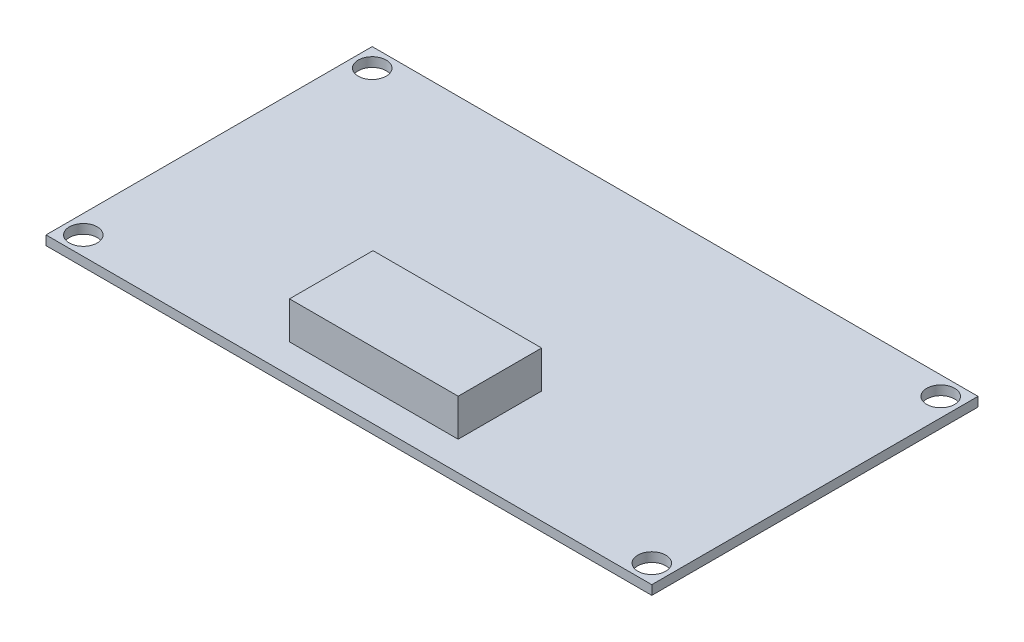
ISO-10303-21;
HEADER;
FILE_DESCRIPTION(('STEP AP214'),'2;1');
FILE_NAME('part.step','',(''),(''),'','','');
FILE_SCHEMA(('AUTOMOTIVE_DESIGN { 1 0 10303 214 1 1 1 1 }'));
ENDSEC;
DATA;
#1=APPLICATION_CONTEXT('core data for automotive mechanical design processes');
#2=APPLICATION_PROTOCOL_DEFINITION('international standard','automotive_design',2000,#1);
#3=PRODUCT_CONTEXT('',#1,'mechanical');
#4=PRODUCT('Part','Part','',(#3));
#5=PRODUCT_RELATED_PRODUCT_CATEGORY('part','',(#4));
#6=PRODUCT_DEFINITION_FORMATION('','',#4);
#7=PRODUCT_DEFINITION_CONTEXT('part definition',#1,'design');
#8=PRODUCT_DEFINITION('design','',#6,#7);
#9=PRODUCT_DEFINITION_SHAPE('','',#8);
#10=(LENGTH_UNIT() NAMED_UNIT(*) SI_UNIT(.MILLI.,.METRE.));
#11=(NAMED_UNIT(*) PLANE_ANGLE_UNIT() SI_UNIT($,.RADIAN.));
#12=(NAMED_UNIT(*) SI_UNIT($,.STERADIAN.) SOLID_ANGLE_UNIT());
#13=UNCERTAINTY_MEASURE_WITH_UNIT(LENGTH_MEASURE(1.E-05),#10,'distance_accuracy_value','');
#14=(GEOMETRIC_REPRESENTATION_CONTEXT(3) GLOBAL_UNCERTAINTY_ASSIGNED_CONTEXT((#13)) GLOBAL_UNIT_ASSIGNED_CONTEXT((#10,
#11,#12)) REPRESENTATION_CONTEXT('',''));
#15=CARTESIAN_POINT('',(0.,0.,0.));
#16=DIRECTION('',(0.,0.,1.));
#17=DIRECTION('',(1.,0.,0.));
#18=AXIS2_PLACEMENT_3D('',#15,#16,#17);
#19=CARTESIAN_POINT('',(0.,1.,0.));
#20=DIRECTION('',(0.,1.,0.));
#21=DIRECTION('',(0.,0.,1.));
#22=AXIS2_PLACEMENT_3D('',#19,#20,#21);
#23=PLANE('',#22);
#24=CARTESIAN_POINT('',(-30.5,1.,-15.5));
#25=DIRECTION('',(0.,1.,0.));
#26=DIRECTION('',(0.,0.,1.));
#27=AXIS2_PLACEMENT_3D('',#24,#25,#26);
#28=CIRCLE('',#27,1.49999999999999);
#29=CARTESIAN_POINT('',(-30.5,1.,-14.));
#30=VERTEX_POINT('',#29);
#31=EDGE_CURVE('E134',#30,#30,#28,.T.);
#32=ORIENTED_EDGE('',*,*,#31,.F.);
#33=EDGE_LOOP('',(#32));
#34=FACE_BOUND('',#33,.T.);
#35=CARTESIAN_POINT('',(-30.5,1.,15.5));
#36=DIRECTION('',(0.,1.,0.));
#37=DIRECTION('',(0.,0.,1.));
#38=AXIS2_PLACEMENT_3D('',#35,#36,#37);
#39=CIRCLE('',#38,1.49999999999999);
#40=CARTESIAN_POINT('',(-30.5,1.,17.));
#41=VERTEX_POINT('',#40);
#42=EDGE_CURVE('E144',#41,#41,#39,.T.);
#43=ORIENTED_EDGE('',*,*,#42,.F.);
#44=EDGE_LOOP('',(#43));
#45=FACE_BOUND('',#44,.T.);
#46=CARTESIAN_POINT('',(30.5,1.,15.5));
#47=DIRECTION('',(0.,1.,0.));
#48=DIRECTION('',(0.,0.,1.));
#49=AXIS2_PLACEMENT_3D('',#46,#47,#48);
#50=CIRCLE('',#49,1.49999999999999);
#51=CARTESIAN_POINT('',(30.5,1.,17.));
#52=VERTEX_POINT('',#51);
#53=EDGE_CURVE('E150',#52,#52,#50,.T.);
#54=ORIENTED_EDGE('',*,*,#53,.F.);
#55=EDGE_LOOP('',(#54));
#56=FACE_BOUND('',#55,.T.);
#57=CARTESIAN_POINT('',(30.5,1.,-15.5));
#58=DIRECTION('',(0.,1.,0.));
#59=DIRECTION('',(0.,0.,1.));
#60=AXIS2_PLACEMENT_3D('',#57,#58,#59);
#61=CIRCLE('',#60,1.49999999999999);
#62=CARTESIAN_POINT('',(30.5,1.,-14.));
#63=VERTEX_POINT('',#62);
#64=EDGE_CURVE('E156',#63,#63,#61,.T.);
#65=ORIENTED_EDGE('',*,*,#64,.F.);
#66=EDGE_LOOP('',(#65));
#67=FACE_BOUND('',#66,.T.);
#68=DIRECTION('',(0.,0.,-1.));
#69=VECTOR('',#68,1.);
#70=CARTESIAN_POINT('',(32.5,1.,-17.5));
#71=LINE('',#70,#69);
#72=CARTESIAN_POINT('',(32.5,1.,17.5));
#73=VERTEX_POINT('',#72);
#74=CARTESIAN_POINT('',(32.5,1.,-17.5));
#75=VERTEX_POINT('',#74);
#76=EDGE_CURVE('E163',#73,#75,#71,.T.);
#77=ORIENTED_EDGE('',*,*,#76,.T.);
#78=DIRECTION('',(-1.,0.,0.));
#79=VECTOR('',#78,1.);
#80=CARTESIAN_POINT('',(-32.5,1.,-17.5));
#81=LINE('',#80,#79);
#82=CARTESIAN_POINT('',(-32.5,1.,-17.5));
#83=VERTEX_POINT('',#82);
#84=EDGE_CURVE('E87',#75,#83,#81,.T.);
#85=ORIENTED_EDGE('',*,*,#84,.T.);
#86=DIRECTION('',(0.,0.,1.));
#87=VECTOR('',#86,1.);
#88=CARTESIAN_POINT('',(-32.5,1.,-17.5));
#89=LINE('',#88,#87);
#90=CARTESIAN_POINT('',(-32.5,1.,17.5));
#91=VERTEX_POINT('',#90);
#92=EDGE_CURVE('E166',#83,#91,#89,.T.);
#93=ORIENTED_EDGE('',*,*,#92,.T.);
#94=DIRECTION('',(1.,0.,0.));
#95=VECTOR('',#94,1.);
#96=CARTESIAN_POINT('',(-32.5,1.,17.5));
#97=LINE('',#96,#95);
#98=EDGE_CURVE('E59',#91,#73,#97,.T.);
#99=ORIENTED_EDGE('',*,*,#98,.T.);
#100=EDGE_LOOP('',(#77,#85,#93,#99));
#101=FACE_BOUND('',#100,.T.);
#102=DIRECTION('',(1.,0.,0.));
#103=VECTOR('',#102,1.);
#104=CARTESIAN_POINT('',(-9.49450101104375,1.,14.3761076629483));
#105=LINE('',#104,#103);
#106=CARTESIAN_POINT('',(-9.49450101104375,1.,14.3761076629483));
#107=VERTEX_POINT('',#106);
#108=CARTESIAN_POINT('',(8.59879336849245,1.,14.3761076629483));
#109=VERTEX_POINT('',#108);
#110=EDGE_CURVE('E333',#107,#109,#105,.T.);
#111=ORIENTED_EDGE('',*,*,#110,.F.);
#112=DIRECTION('',(0.,0.,1.));
#113=VECTOR('',#112,1.);
#114=CARTESIAN_POINT('',(-9.49450101104375,1.,5.41903123743535));
#115=LINE('',#114,#113);
#116=CARTESIAN_POINT('',(-9.49450101104375,1.,5.41903123743535));
#117=VERTEX_POINT('',#116);
#118=EDGE_CURVE('E132',#117,#107,#115,.T.);
#119=ORIENTED_EDGE('',*,*,#118,.F.);
#120=DIRECTION('',(-1.,0.,0.));
#121=VECTOR('',#120,1.);
#122=CARTESIAN_POINT('',(-9.49450101104375,1.,5.41903123743535));
#123=LINE('',#122,#121);
#124=CARTESIAN_POINT('',(8.59879336849245,1.,5.41903123743535));
#125=VERTEX_POINT('',#124);
#126=EDGE_CURVE('E128',#125,#117,#123,.T.);
#127=ORIENTED_EDGE('',*,*,#126,.F.);
#128=DIRECTION('',(0.,0.,-1.));
#129=VECTOR('',#128,1.);
#130=CARTESIAN_POINT('',(8.59879336849245,1.,5.41903123743535));
#131=LINE('',#130,#129);
#132=EDGE_CURVE('E330',#109,#125,#131,.T.);
#133=ORIENTED_EDGE('',*,*,#132,.F.);
#134=EDGE_LOOP('',(#111,#119,#127,#133));
#135=FACE_BOUND('',#134,.T.);
#136=ADVANCED_FACE('F35',(#34,#45,#56,#67,#101,#135),#23,.T.);
#137=CARTESIAN_POINT('',(32.5,1.,-17.5));
#138=DIRECTION('',(-1.,0.,0.));
#139=DIRECTION('',(0.,0.,1.));
#140=AXIS2_PLACEMENT_3D('',#137,#138,#139);
#141=PLANE('',#140);
#142=DIRECTION('',(0.,0.,-1.));
#143=VECTOR('',#142,1.);
#144=CARTESIAN_POINT('',(32.5,0.,-17.5));
#145=LINE('',#144,#143);
#146=CARTESIAN_POINT('',(32.5,0.,17.5));
#147=VERTEX_POINT('',#146);
#148=CARTESIAN_POINT('',(32.5,0.,-17.5));
#149=VERTEX_POINT('',#148);
#150=EDGE_CURVE('E162',#147,#149,#145,.T.);
#151=ORIENTED_EDGE('',*,*,#150,.T.);
#152=DIRECTION('',(0.,-1.,0.));
#153=VECTOR('',#152,1.);
#154=CARTESIAN_POINT('',(32.5,1.,-17.5));
#155=LINE('',#154,#153);
#156=EDGE_CURVE('E11',#75,#149,#155,.T.);
#157=ORIENTED_EDGE('',*,*,#156,.F.);
#158=ORIENTED_EDGE('',*,*,#76,.F.);
#159=DIRECTION('',(0.,-1.,0.));
#160=VECTOR('',#159,1.);
#161=CARTESIAN_POINT('',(32.5,1.,17.5));
#162=LINE('',#161,#160);
#163=EDGE_CURVE('E169',#73,#147,#162,.T.);
#164=ORIENTED_EDGE('',*,*,#163,.T.);
#165=EDGE_LOOP('',(#151,#157,#158,#164));
#166=FACE_BOUND('',#165,.T.);
#167=ADVANCED_FACE('F37',(#166),#141,.F.);
#168=CARTESIAN_POINT('',(-32.5,1.,-17.5));
#169=DIRECTION('',(0.,0.,1.));
#170=DIRECTION('',(1.,0.,0.));
#171=AXIS2_PLACEMENT_3D('',#168,#169,#170);
#172=PLANE('',#171);
#173=DIRECTION('',(-1.,0.,0.));
#174=VECTOR('',#173,1.);
#175=CARTESIAN_POINT('',(-32.5,0.,-17.5));
#176=LINE('',#175,#174);
#177=CARTESIAN_POINT('',(-32.5,0.,-17.5));
#178=VERTEX_POINT('',#177);
#179=EDGE_CURVE('E172',#149,#178,#176,.T.);
#180=ORIENTED_EDGE('',*,*,#179,.T.);
#181=DIRECTION('',(0.,-1.,0.));
#182=VECTOR('',#181,1.);
#183=CARTESIAN_POINT('',(-32.5,1.,-17.5));
#184=LINE('',#183,#182);
#185=EDGE_CURVE('E43',#83,#178,#184,.T.);
#186=ORIENTED_EDGE('',*,*,#185,.F.);
#187=ORIENTED_EDGE('',*,*,#84,.F.);
#188=ORIENTED_EDGE('',*,*,#156,.T.);
#189=EDGE_LOOP('',(#180,#186,#187,#188));
#190=FACE_BOUND('',#189,.T.);
#191=ADVANCED_FACE('F201',(#190),#172,.F.);
#192=CARTESIAN_POINT('',(-32.5,1.,-17.5));
#193=DIRECTION('',(1.,0.,0.));
#194=DIRECTION('',(0.,0.,-1.));
#195=AXIS2_PLACEMENT_3D('',#192,#193,#194);
#196=PLANE('',#195);
#197=DIRECTION('',(0.,0.,1.));
#198=VECTOR('',#197,1.);
#199=CARTESIAN_POINT('',(-32.5,0.,-17.5));
#200=LINE('',#199,#198);
#201=CARTESIAN_POINT('',(-32.5,0.,17.5));
#202=VERTEX_POINT('',#201);
#203=EDGE_CURVE('E174',#178,#202,#200,.T.);
#204=ORIENTED_EDGE('',*,*,#203,.T.);
#205=DIRECTION('',(0.,-1.,0.));
#206=VECTOR('',#205,1.);
#207=CARTESIAN_POINT('',(-32.5,1.,17.5));
#208=LINE('',#207,#206);
#209=EDGE_CURVE('E178',#91,#202,#208,.T.);
#210=ORIENTED_EDGE('',*,*,#209,.F.);
#211=ORIENTED_EDGE('',*,*,#92,.F.);
#212=ORIENTED_EDGE('',*,*,#185,.T.);
#213=EDGE_LOOP('',(#204,#210,#211,#212));
#214=FACE_BOUND('',#213,.T.);
#215=ADVANCED_FACE('F183',(#214),#196,.F.);
#216=CARTESIAN_POINT('',(-32.5,1.,17.5));
#217=DIRECTION('',(0.,0.,-1.));
#218=DIRECTION('',(-1.,0.,0.));
#219=AXIS2_PLACEMENT_3D('',#216,#217,#218);
#220=PLANE('',#219);
#221=DIRECTION('',(1.,0.,0.));
#222=VECTOR('',#221,1.);
#223=CARTESIAN_POINT('',(-32.5,0.,17.5));
#224=LINE('',#223,#222);
#225=EDGE_CURVE('E80',#202,#147,#224,.T.);
#226=ORIENTED_EDGE('',*,*,#225,.T.);
#227=ORIENTED_EDGE('',*,*,#163,.F.);
#228=ORIENTED_EDGE('',*,*,#98,.F.);
#229=ORIENTED_EDGE('',*,*,#209,.T.);
#230=EDGE_LOOP('',(#226,#227,#228,#229));
#231=FACE_BOUND('',#230,.T.);
#232=ADVANCED_FACE('F191',(#231),#220,.F.);
#233=CARTESIAN_POINT('',(0.,0.,0.));
#234=DIRECTION('',(0.,1.,0.));
#235=DIRECTION('',(0.,0.,1.));
#236=AXIS2_PLACEMENT_3D('',#233,#234,#235);
#237=PLANE('',#236);
#238=CARTESIAN_POINT('',(-30.5,0.,-15.5));
#239=DIRECTION('',(0.,1.,0.));
#240=DIRECTION('',(0.,0.,1.));
#241=AXIS2_PLACEMENT_3D('',#238,#239,#240);
#242=CIRCLE('',#241,1.49999999999999);
#243=CARTESIAN_POINT('',(-30.5,0.,-14.));
#244=VERTEX_POINT('',#243);
#245=EDGE_CURVE('E137',#244,#244,#242,.T.);
#246=ORIENTED_EDGE('',*,*,#245,.T.);
#247=EDGE_LOOP('',(#246));
#248=FACE_BOUND('',#247,.T.);
#249=CARTESIAN_POINT('',(-30.5,0.,15.5));
#250=DIRECTION('',(0.,1.,0.));
#251=DIRECTION('',(0.,0.,1.));
#252=AXIS2_PLACEMENT_3D('',#249,#250,#251);
#253=CIRCLE('',#252,1.49999999999999);
#254=CARTESIAN_POINT('',(-30.5,0.,17.));
#255=VERTEX_POINT('',#254);
#256=EDGE_CURVE('E147',#255,#255,#253,.T.);
#257=ORIENTED_EDGE('',*,*,#256,.T.);
#258=EDGE_LOOP('',(#257));
#259=FACE_BOUND('',#258,.T.);
#260=CARTESIAN_POINT('',(30.5,0.,15.5));
#261=DIRECTION('',(0.,1.,0.));
#262=DIRECTION('',(0.,0.,1.));
#263=AXIS2_PLACEMENT_3D('',#260,#261,#262);
#264=CIRCLE('',#263,1.49999999999999);
#265=CARTESIAN_POINT('',(30.5,0.,17.));
#266=VERTEX_POINT('',#265);
#267=EDGE_CURVE('E153',#266,#266,#264,.T.);
#268=ORIENTED_EDGE('',*,*,#267,.T.);
#269=EDGE_LOOP('',(#268));
#270=FACE_BOUND('',#269,.T.);
#271=CARTESIAN_POINT('',(30.5,0.,-15.5));
#272=DIRECTION('',(0.,1.,0.));
#273=DIRECTION('',(0.,0.,1.));
#274=AXIS2_PLACEMENT_3D('',#271,#272,#273);
#275=CIRCLE('',#274,1.49999999999999);
#276=CARTESIAN_POINT('',(30.5,0.,-14.));
#277=VERTEX_POINT('',#276);
#278=EDGE_CURVE('E159',#277,#277,#275,.T.);
#279=ORIENTED_EDGE('',*,*,#278,.T.);
#280=EDGE_LOOP('',(#279));
#281=FACE_BOUND('',#280,.T.);
#282=ORIENTED_EDGE('',*,*,#150,.F.);
#283=ORIENTED_EDGE('',*,*,#225,.F.);
#284=ORIENTED_EDGE('',*,*,#203,.F.);
#285=ORIENTED_EDGE('',*,*,#179,.F.);
#286=EDGE_LOOP('',(#282,#283,#284,#285));
#287=FACE_BOUND('',#286,.T.);
#288=ADVANCED_FACE('F187',(#248,#259,#270,#281,#287),#237,.F.);
#289=CARTESIAN_POINT('',(30.5,1.,-15.5));
#290=DIRECTION('',(0.,1.,0.));
#291=DIRECTION('',(0.,0.,1.));
#292=AXIS2_PLACEMENT_3D('',#289,#290,#291);
#293=CYLINDRICAL_SURFACE('',#292,1.49999999999999);
#294=ORIENTED_EDGE('',*,*,#64,.T.);
#295=EDGE_LOOP('',(#294));
#296=FACE_BOUND('',#295,.T.);
#297=ORIENTED_EDGE('',*,*,#278,.F.);
#298=EDGE_LOOP('',(#297));
#299=FACE_BOUND('',#298,.T.);
#300=ADVANCED_FACE('F198',(#296,#299),#293,.F.);
#301=CARTESIAN_POINT('',(30.5,1.,15.5));
#302=DIRECTION('',(0.,1.,0.));
#303=DIRECTION('',(0.,0.,1.));
#304=AXIS2_PLACEMENT_3D('',#301,#302,#303);
#305=CYLINDRICAL_SURFACE('',#304,1.49999999999999);
#306=ORIENTED_EDGE('',*,*,#53,.T.);
#307=EDGE_LOOP('',(#306));
#308=FACE_BOUND('',#307,.T.);
#309=ORIENTED_EDGE('',*,*,#267,.F.);
#310=EDGE_LOOP('',(#309));
#311=FACE_BOUND('',#310,.T.);
#312=ADVANCED_FACE('F214',(#308,#311),#305,.F.);
#313=CARTESIAN_POINT('',(-30.5,1.,15.5));
#314=DIRECTION('',(0.,1.,0.));
#315=DIRECTION('',(0.,0.,1.));
#316=AXIS2_PLACEMENT_3D('',#313,#314,#315);
#317=CYLINDRICAL_SURFACE('',#316,1.49999999999999);
#318=ORIENTED_EDGE('',*,*,#42,.T.);
#319=EDGE_LOOP('',(#318));
#320=FACE_BOUND('',#319,.T.);
#321=ORIENTED_EDGE('',*,*,#256,.F.);
#322=EDGE_LOOP('',(#321));
#323=FACE_BOUND('',#322,.T.);
#324=ADVANCED_FACE('F218',(#320,#323),#317,.F.);
#325=CARTESIAN_POINT('',(-30.5,1.,-15.5));
#326=DIRECTION('',(0.,1.,0.));
#327=DIRECTION('',(0.,0.,1.));
#328=AXIS2_PLACEMENT_3D('',#325,#326,#327);
#329=CYLINDRICAL_SURFACE('',#328,1.49999999999999);
#330=ORIENTED_EDGE('',*,*,#31,.T.);
#331=EDGE_LOOP('',(#330));
#332=FACE_BOUND('',#331,.T.);
#333=ORIENTED_EDGE('',*,*,#245,.F.);
#334=EDGE_LOOP('',(#333));
#335=FACE_BOUND('',#334,.T.);
#336=ADVANCED_FACE('F222',(#332,#335),#329,.F.);
#337=CARTESIAN_POINT('',(-9.49450101104375,5.,5.41903123743535));
#338=DIRECTION('',(1.,0.,0.));
#339=DIRECTION('',(0.,0.,-1.));
#340=AXIS2_PLACEMENT_3D('',#337,#338,#339);
#341=PLANE('',#340);
#342=ORIENTED_EDGE('',*,*,#118,.T.);
#343=DIRECTION('',(0.,-1.,0.));
#344=VECTOR('',#343,1.);
#345=CARTESIAN_POINT('',(-9.49450101104375,5.,14.3761076629483));
#346=LINE('',#345,#344);
#347=CARTESIAN_POINT('',(-9.49450101104375,5.,14.3761076629483));
#348=VERTEX_POINT('',#347);
#349=EDGE_CURVE('E113',#348,#107,#346,.T.);
#350=ORIENTED_EDGE('',*,*,#349,.F.);
#351=DIRECTION('',(0.,0.,1.));
#352=VECTOR('',#351,1.);
#353=CARTESIAN_POINT('',(-9.49450101104375,5.,5.41903123743535));
#354=LINE('',#353,#352);
#355=CARTESIAN_POINT('',(-9.49450101104375,5.,5.41903123743535));
#356=VERTEX_POINT('',#355);
#357=EDGE_CURVE('E120',#356,#348,#354,.T.);
#358=ORIENTED_EDGE('',*,*,#357,.F.);
#359=DIRECTION('',(0.,-1.,0.));
#360=VECTOR('',#359,1.);
#361=CARTESIAN_POINT('',(-9.49450101104375,5.,5.41903123743535));
#362=LINE('',#361,#360);
#363=EDGE_CURVE('E327',#356,#117,#362,.T.);
#364=ORIENTED_EDGE('',*,*,#363,.T.);
#365=EDGE_LOOP('',(#342,#350,#358,#364));
#366=FACE_BOUND('',#365,.T.);
#367=ADVANCED_FACE('F130',(#366),#341,.F.);
#368=CARTESIAN_POINT('',(-9.49450101104375,5.,14.3761076629483));
#369=DIRECTION('',(0.,0.,-1.));
#370=DIRECTION('',(-1.,0.,0.));
#371=AXIS2_PLACEMENT_3D('',#368,#369,#370);
#372=PLANE('',#371);
#373=ORIENTED_EDGE('',*,*,#110,.T.);
#374=DIRECTION('',(0.,-1.,0.));
#375=VECTOR('',#374,1.);
#376=CARTESIAN_POINT('',(8.59879336849245,5.,14.3761076629483));
#377=LINE('',#376,#375);
#378=CARTESIAN_POINT('',(8.59879336849245,5.,14.3761076629483));
#379=VERTEX_POINT('',#378);
#380=EDGE_CURVE('E116',#379,#109,#377,.T.);
#381=ORIENTED_EDGE('',*,*,#380,.F.);
#382=DIRECTION('',(1.,0.,0.));
#383=VECTOR('',#382,1.);
#384=CARTESIAN_POINT('',(-9.49450101104375,5.,14.3761076629483));
#385=LINE('',#384,#383);
#386=EDGE_CURVE('E109',#348,#379,#385,.T.);
#387=ORIENTED_EDGE('',*,*,#386,.F.);
#388=ORIENTED_EDGE('',*,*,#349,.T.);
#389=EDGE_LOOP('',(#373,#381,#387,#388));
#390=FACE_BOUND('',#389,.T.);
#391=ADVANCED_FACE('F111',(#390),#372,.F.);
#392=CARTESIAN_POINT('',(8.59879336849245,5.,5.41903123743535));
#393=DIRECTION('',(-1.,0.,0.));
#394=DIRECTION('',(0.,0.,1.));
#395=AXIS2_PLACEMENT_3D('',#392,#393,#394);
#396=PLANE('',#395);
#397=ORIENTED_EDGE('',*,*,#132,.T.);
#398=DIRECTION('',(0.,-1.,0.));
#399=VECTOR('',#398,1.);
#400=CARTESIAN_POINT('',(8.59879336849245,5.,5.41903123743535));
#401=LINE('',#400,#399);
#402=CARTESIAN_POINT('',(8.59879336849245,5.,5.41903123743535));
#403=VERTEX_POINT('',#402);
#404=EDGE_CURVE('E50',#403,#125,#401,.T.);
#405=ORIENTED_EDGE('',*,*,#404,.F.);
#406=DIRECTION('',(0.,0.,-1.));
#407=VECTOR('',#406,1.);
#408=CARTESIAN_POINT('',(8.59879336849245,5.,5.41903123743535));
#409=LINE('',#408,#407);
#410=EDGE_CURVE('E119',#379,#403,#409,.T.);
#411=ORIENTED_EDGE('',*,*,#410,.F.);
#412=ORIENTED_EDGE('',*,*,#380,.T.);
#413=EDGE_LOOP('',(#397,#405,#411,#412));
#414=FACE_BOUND('',#413,.T.);
#415=ADVANCED_FACE('F231',(#414),#396,.F.);
#416=CARTESIAN_POINT('',(-9.49450101104375,5.,5.41903123743535));
#417=DIRECTION('',(0.,0.,1.));
#418=DIRECTION('',(1.,0.,0.));
#419=AXIS2_PLACEMENT_3D('',#416,#417,#418);
#420=PLANE('',#419);
#421=ORIENTED_EDGE('',*,*,#126,.T.);
#422=ORIENTED_EDGE('',*,*,#363,.F.);
#423=DIRECTION('',(-1.,0.,0.));
#424=VECTOR('',#423,1.);
#425=CARTESIAN_POINT('',(-9.49450101104375,5.,5.41903123743535));
#426=LINE('',#425,#424);
#427=EDGE_CURVE('E124',#403,#356,#426,.T.);
#428=ORIENTED_EDGE('',*,*,#427,.F.);
#429=ORIENTED_EDGE('',*,*,#404,.T.);
#430=EDGE_LOOP('',(#421,#422,#428,#429));
#431=FACE_BOUND('',#430,.T.);
#432=ADVANCED_FACE('F234',(#431),#420,.F.);
#433=CARTESIAN_POINT('',(0.,5.,0.));
#434=DIRECTION('',(0.,1.,0.));
#435=DIRECTION('',(0.,0.,1.));
#436=AXIS2_PLACEMENT_3D('',#433,#434,#435);
#437=PLANE('',#436);
#438=ORIENTED_EDGE('',*,*,#357,.T.);
#439=ORIENTED_EDGE('',*,*,#386,.T.);
#440=ORIENTED_EDGE('',*,*,#410,.T.);
#441=ORIENTED_EDGE('',*,*,#427,.T.);
#442=EDGE_LOOP('',(#438,#439,#440,#441));
#443=FACE_BOUND('',#442,.T.);
#444=ADVANCED_FACE('F123',(#443),#437,.T.);
#445=CLOSED_SHELL('',(#136,#167,#191,#215,#232,#288,#300,#312,#324,#336,#367,#391,#415,#432,#444));
#446=MANIFOLD_SOLID_BREP('B2',#445);
#447=ADVANCED_BREP_SHAPE_REPRESENTATION('',(#18,#446),#14);
#448=SHAPE_DEFINITION_REPRESENTATION(#9,#447);
ENDSEC;
END-ISO-10303-21;
